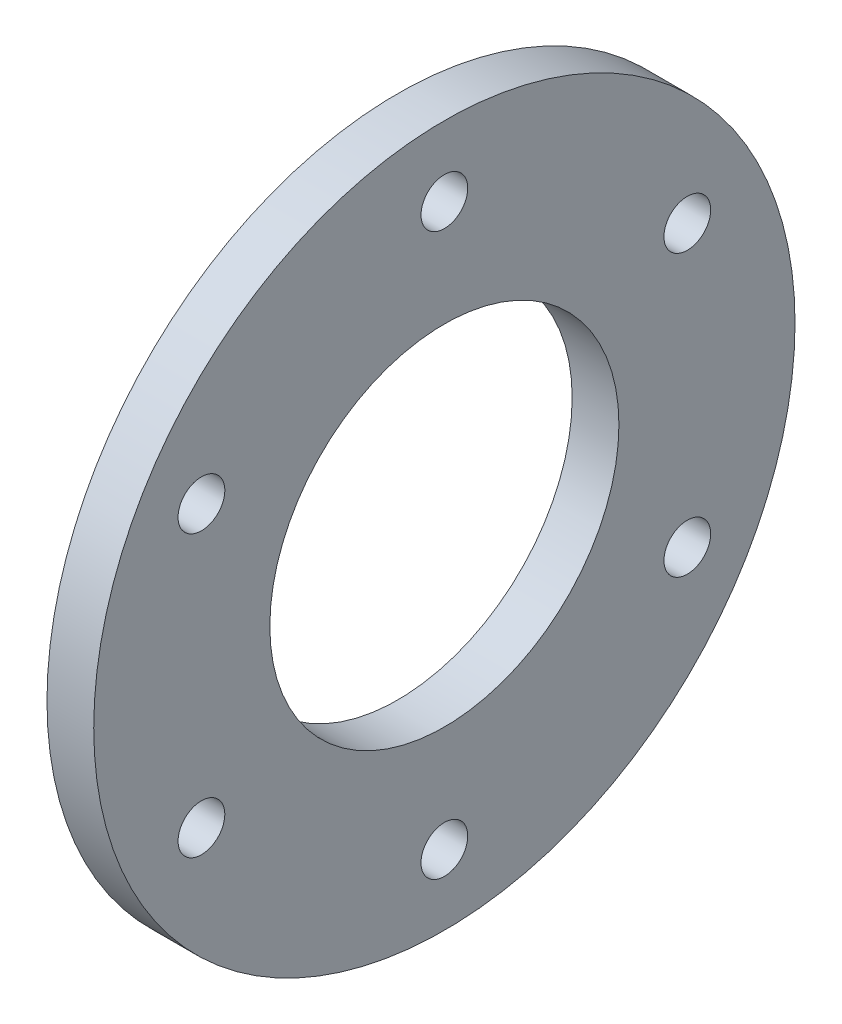
ISO-10303-21;
HEADER;
FILE_DESCRIPTION(('STEP AP214'),'2;1');
FILE_NAME('part.step','',(''),(''),'','','');
FILE_SCHEMA(('AUTOMOTIVE_DESIGN { 1 0 10303 214 1 1 1 1 }'));
ENDSEC;
DATA;
#1=APPLICATION_CONTEXT('core data for automotive mechanical design processes');
#2=APPLICATION_PROTOCOL_DEFINITION('international standard','automotive_design',2000,#1);
#3=PRODUCT_CONTEXT('',#1,'mechanical');
#4=PRODUCT('Part','Part','',(#3));
#5=PRODUCT_RELATED_PRODUCT_CATEGORY('part','',(#4));
#6=PRODUCT_DEFINITION_FORMATION('','',#4);
#7=PRODUCT_DEFINITION_CONTEXT('part definition',#1,'design');
#8=PRODUCT_DEFINITION('design','',#6,#7);
#9=PRODUCT_DEFINITION_SHAPE('','',#8);
#10=(LENGTH_UNIT() NAMED_UNIT(*) SI_UNIT(.MILLI.,.METRE.));
#11=(NAMED_UNIT(*) PLANE_ANGLE_UNIT() SI_UNIT($,.RADIAN.));
#12=(NAMED_UNIT(*) SI_UNIT($,.STERADIAN.) SOLID_ANGLE_UNIT());
#13=UNCERTAINTY_MEASURE_WITH_UNIT(LENGTH_MEASURE(1.E-05),#10,'distance_accuracy_value','');
#14=(GEOMETRIC_REPRESENTATION_CONTEXT(3) GLOBAL_UNCERTAINTY_ASSIGNED_CONTEXT((#13)) GLOBAL_UNIT_ASSIGNED_CONTEXT((#10,
#11,#12)) REPRESENTATION_CONTEXT('',''));
#15=CARTESIAN_POINT('',(0.,0.,0.));
#16=DIRECTION('',(0.,0.,1.));
#17=DIRECTION('',(1.,0.,0.));
#18=AXIS2_PLACEMENT_3D('',#15,#16,#17);
#19=CARTESIAN_POINT('',(3.,0.,0.));
#20=DIRECTION('',(1.,0.,0.));
#21=DIRECTION('',(0.,0.,-1.));
#22=AXIS2_PLACEMENT_3D('',#19,#20,#21);
#23=PLANE('',#22);
#24=CARTESIAN_POINT('',(3.,9.00000000000018,15.5884572681198));
#25=DIRECTION('',(1.,0.,0.));
#26=DIRECTION('',(0.,0.866025403784433,-0.50000000000001));
#27=AXIS2_PLACEMENT_3D('',#24,#25,#26);
#28=CIRCLE('',#27,1.5);
#29=CARTESIAN_POINT('',(3.,10.2990381056768,14.8384572681198));
#30=VERTEX_POINT('',#29);
#31=EDGE_CURVE('E83',#30,#30,#28,.T.);
#32=ORIENTED_EDGE('',*,*,#31,.F.);
#33=EDGE_LOOP('',(#32));
#34=FACE_BOUND('',#33,.T.);
#35=CARTESIAN_POINT('',(3.,-8.99999999999985,15.58845726812));
#36=DIRECTION('',(1.,0.,0.));
#37=DIRECTION('',(0.,0.866025403784443,0.499999999999992));
#38=AXIS2_PLACEMENT_3D('',#35,#36,#37);
#39=CIRCLE('',#38,1.5);
#40=CARTESIAN_POINT('',(3.,-7.70096189432319,16.33845726812));
#41=VERTEX_POINT('',#40);
#42=EDGE_CURVE('E77',#41,#41,#39,.T.);
#43=ORIENTED_EDGE('',*,*,#42,.F.);
#44=EDGE_LOOP('',(#43));
#45=FACE_BOUND('',#44,.T.);
#46=CARTESIAN_POINT('',(3.,-18.,1.25693400999938E-13));
#47=DIRECTION('',(1.,0.,0.));
#48=DIRECTION('',(0.,0.,1.));
#49=AXIS2_PLACEMENT_3D('',#46,#47,#48);
#50=CIRCLE('',#49,1.5);
#51=CARTESIAN_POINT('',(3.,-18.,1.50000000000013));
#52=VERTEX_POINT('',#51);
#53=EDGE_CURVE('E71',#52,#52,#50,.T.);
#54=ORIENTED_EDGE('',*,*,#53,.F.);
#55=EDGE_LOOP('',(#54));
#56=FACE_BOUND('',#55,.T.);
#57=CARTESIAN_POINT('',(3.,-9.00000000000007,-15.5884572681199));
#58=DIRECTION('',(1.,0.,0.));
#59=DIRECTION('',(0.,-0.866025403784436,0.500000000000004));
#60=AXIS2_PLACEMENT_3D('',#57,#58,#59);
#61=CIRCLE('',#60,1.5);
#62=CARTESIAN_POINT('',(3.,-10.2990381056767,-14.8384572681198));
#63=VERTEX_POINT('',#62);
#64=EDGE_CURVE('E65',#63,#63,#61,.T.);
#65=ORIENTED_EDGE('',*,*,#64,.F.);
#66=EDGE_LOOP('',(#65));
#67=FACE_BOUND('',#66,.T.);
#68=CARTESIAN_POINT('',(3.,8.99999999999996,-15.5884572681199));
#69=DIRECTION('',(1.,0.,0.));
#70=DIRECTION('',(0.,-0.86602540378444,-0.499999999999998));
#71=AXIS2_PLACEMENT_3D('',#68,#69,#70);
#72=CIRCLE('',#71,1.5);
#73=CARTESIAN_POINT('',(3.,7.7009618943233,-16.3384572681199));
#74=VERTEX_POINT('',#73);
#75=EDGE_CURVE('E59',#74,#74,#72,.T.);
#76=ORIENTED_EDGE('',*,*,#75,.F.);
#77=EDGE_LOOP('',(#76));
#78=FACE_BOUND('',#77,.T.);
#79=CARTESIAN_POINT('',(3.,18.,0.));
#80=DIRECTION('',(1.,0.,0.));
#81=DIRECTION('',(0.,0.,-1.));
#82=AXIS2_PLACEMENT_3D('',#79,#80,#81);
#83=CIRCLE('',#82,1.5);
#84=CARTESIAN_POINT('',(3.,18.,-1.5));
#85=VERTEX_POINT('',#84);
#86=EDGE_CURVE('E53',#85,#85,#83,.T.);
#87=ORIENTED_EDGE('',*,*,#86,.F.);
#88=EDGE_LOOP('',(#87));
#89=FACE_BOUND('',#88,.T.);
#90=CARTESIAN_POINT('',(3.,0.,0.));
#91=DIRECTION('',(1.,0.,0.));
#92=DIRECTION('',(0.,0.,-1.));
#93=AXIS2_PLACEMENT_3D('',#90,#91,#92);
#94=CIRCLE('',#93,22.5);
#95=CARTESIAN_POINT('',(3.,0.,-22.5));
#96=VERTEX_POINT('',#95);
#97=EDGE_CURVE('E10',#96,#96,#94,.T.);
#98=ORIENTED_EDGE('',*,*,#97,.T.);
#99=EDGE_LOOP('',(#98));
#100=FACE_BOUND('',#99,.T.);
#101=CARTESIAN_POINT('',(3.,0.,0.));
#102=DIRECTION('',(1.,0.,0.));
#103=DIRECTION('',(0.,0.,-1.));
#104=AXIS2_PLACEMENT_3D('',#101,#102,#103);
#105=CIRCLE('',#104,11.2);
#106=CARTESIAN_POINT('',(3.,0.,-11.2));
#107=VERTEX_POINT('',#106);
#108=EDGE_CURVE('E41',#107,#107,#105,.T.);
#109=ORIENTED_EDGE('',*,*,#108,.F.);
#110=EDGE_LOOP('',(#109));
#111=FACE_BOUND('',#110,.T.);
#112=ADVANCED_FACE('F30',(#34,#45,#56,#67,#78,#89,#100,#111),#23,.T.);
#113=CARTESIAN_POINT('',(0.,0.,0.));
#114=DIRECTION('',(1.,0.,0.));
#115=DIRECTION('',(0.,0.,-1.));
#116=AXIS2_PLACEMENT_3D('',#113,#114,#115);
#117=PLANE('',#116);
#118=CARTESIAN_POINT('',(0.,9.00000000000018,15.5884572681198));
#119=DIRECTION('',(1.,0.,0.));
#120=DIRECTION('',(0.,0.866025403784433,-0.50000000000001));
#121=AXIS2_PLACEMENT_3D('',#118,#119,#120);
#122=CIRCLE('',#121,1.5);
#123=CARTESIAN_POINT('',(0.,10.2990381056768,14.8384572681198));
#124=VERTEX_POINT('',#123);
#125=EDGE_CURVE('E80',#124,#124,#122,.T.);
#126=ORIENTED_EDGE('',*,*,#125,.T.);
#127=EDGE_LOOP('',(#126));
#128=FACE_BOUND('',#127,.T.);
#129=CARTESIAN_POINT('',(0.,-8.99999999999985,15.58845726812));
#130=DIRECTION('',(1.,0.,0.));
#131=DIRECTION('',(0.,0.866025403784443,0.499999999999992));
#132=AXIS2_PLACEMENT_3D('',#129,#130,#131);
#133=CIRCLE('',#132,1.5);
#134=CARTESIAN_POINT('',(0.,-7.70096189432319,16.33845726812));
#135=VERTEX_POINT('',#134);
#136=EDGE_CURVE('E74',#135,#135,#133,.T.);
#137=ORIENTED_EDGE('',*,*,#136,.T.);
#138=EDGE_LOOP('',(#137));
#139=FACE_BOUND('',#138,.T.);
#140=CARTESIAN_POINT('',(0.,-18.,1.25693400999938E-13));
#141=DIRECTION('',(1.,0.,0.));
#142=DIRECTION('',(0.,0.,1.));
#143=AXIS2_PLACEMENT_3D('',#140,#141,#142);
#144=CIRCLE('',#143,1.5);
#145=CARTESIAN_POINT('',(0.,-18.,1.50000000000013));
#146=VERTEX_POINT('',#145);
#147=EDGE_CURVE('E68',#146,#146,#144,.T.);
#148=ORIENTED_EDGE('',*,*,#147,.T.);
#149=EDGE_LOOP('',(#148));
#150=FACE_BOUND('',#149,.T.);
#151=CARTESIAN_POINT('',(0.,-9.00000000000007,-15.5884572681199));
#152=DIRECTION('',(1.,0.,0.));
#153=DIRECTION('',(0.,-0.866025403784436,0.500000000000004));
#154=AXIS2_PLACEMENT_3D('',#151,#152,#153);
#155=CIRCLE('',#154,1.5);
#156=CARTESIAN_POINT('',(0.,-10.2990381056767,-14.8384572681198));
#157=VERTEX_POINT('',#156);
#158=EDGE_CURVE('E62',#157,#157,#155,.T.);
#159=ORIENTED_EDGE('',*,*,#158,.T.);
#160=EDGE_LOOP('',(#159));
#161=FACE_BOUND('',#160,.T.);
#162=CARTESIAN_POINT('',(0.,8.99999999999996,-15.5884572681199));
#163=DIRECTION('',(1.,0.,0.));
#164=DIRECTION('',(0.,-0.86602540378444,-0.499999999999998));
#165=AXIS2_PLACEMENT_3D('',#162,#163,#164);
#166=CIRCLE('',#165,1.5);
#167=CARTESIAN_POINT('',(0.,7.7009618943233,-16.3384572681199));
#168=VERTEX_POINT('',#167);
#169=EDGE_CURVE('E56',#168,#168,#166,.T.);
#170=ORIENTED_EDGE('',*,*,#169,.T.);
#171=EDGE_LOOP('',(#170));
#172=FACE_BOUND('',#171,.T.);
#173=CARTESIAN_POINT('',(0.,18.,0.));
#174=DIRECTION('',(1.,0.,0.));
#175=DIRECTION('',(0.,0.,-1.));
#176=AXIS2_PLACEMENT_3D('',#173,#174,#175);
#177=CIRCLE('',#176,1.5);
#178=CARTESIAN_POINT('',(0.,18.,-1.5));
#179=VERTEX_POINT('',#178);
#180=EDGE_CURVE('E50',#179,#179,#177,.T.);
#181=ORIENTED_EDGE('',*,*,#180,.T.);
#182=EDGE_LOOP('',(#181));
#183=FACE_BOUND('',#182,.T.);
#184=CARTESIAN_POINT('',(0.,0.,0.));
#185=DIRECTION('',(1.,0.,0.));
#186=DIRECTION('',(0.,0.,-1.));
#187=AXIS2_PLACEMENT_3D('',#184,#185,#186);
#188=CIRCLE('',#187,22.5);
#189=CARTESIAN_POINT('',(0.,0.,-22.5));
#190=VERTEX_POINT('',#189);
#191=EDGE_CURVE('E37',#190,#190,#188,.T.);
#192=ORIENTED_EDGE('',*,*,#191,.F.);
#193=EDGE_LOOP('',(#192));
#194=FACE_BOUND('',#193,.T.);
#195=CARTESIAN_POINT('',(0.,0.,0.));
#196=DIRECTION('',(1.,0.,0.));
#197=DIRECTION('',(0.,0.,-1.));
#198=AXIS2_PLACEMENT_3D('',#195,#196,#197);
#199=CIRCLE('',#198,11.2);
#200=CARTESIAN_POINT('',(0.,0.,-11.2));
#201=VERTEX_POINT('',#200);
#202=EDGE_CURVE('E45',#201,#201,#199,.T.);
#203=ORIENTED_EDGE('',*,*,#202,.T.);
#204=EDGE_LOOP('',(#203));
#205=FACE_BOUND('',#204,.T.);
#206=ADVANCED_FACE('F91',(#128,#139,#150,#161,#172,#183,#194,#205),#117,.F.);
#207=CARTESIAN_POINT('',(3.,0.,0.));
#208=DIRECTION('',(-1.,0.,0.));
#209=DIRECTION('',(0.,0.,1.));
#210=AXIS2_PLACEMENT_3D('',#207,#208,#209);
#211=CYLINDRICAL_SURFACE('',#210,22.5);
#212=ORIENTED_EDGE('',*,*,#97,.F.);
#213=EDGE_LOOP('',(#212));
#214=FACE_BOUND('',#213,.T.);
#215=ORIENTED_EDGE('',*,*,#191,.T.);
#216=EDGE_LOOP('',(#215));
#217=FACE_BOUND('',#216,.T.);
#218=ADVANCED_FACE('F32',(#214,#217),#211,.T.);
#219=CARTESIAN_POINT('',(3.,0.,0.));
#220=DIRECTION('',(-1.,0.,0.));
#221=DIRECTION('',(0.,0.,1.));
#222=AXIS2_PLACEMENT_3D('',#219,#220,#221);
#223=CYLINDRICAL_SURFACE('',#222,11.2);
#224=ORIENTED_EDGE('',*,*,#108,.T.);
#225=EDGE_LOOP('',(#224));
#226=FACE_BOUND('',#225,.T.);
#227=ORIENTED_EDGE('',*,*,#202,.F.);
#228=EDGE_LOOP('',(#227));
#229=FACE_BOUND('',#228,.T.);
#230=ADVANCED_FACE('F104',(#226,#229),#223,.F.);
#231=CARTESIAN_POINT('',(0.,18.,0.));
#232=DIRECTION('',(1.,0.,0.));
#233=DIRECTION('',(0.,0.,-1.));
#234=AXIS2_PLACEMENT_3D('',#231,#232,#233);
#235=CYLINDRICAL_SURFACE('',#234,1.5);
#236=ORIENTED_EDGE('',*,*,#180,.F.);
#237=EDGE_LOOP('',(#236));
#238=FACE_BOUND('',#237,.T.);
#239=ORIENTED_EDGE('',*,*,#86,.T.);
#240=EDGE_LOOP('',(#239));
#241=FACE_BOUND('',#240,.T.);
#242=ADVANCED_FACE('F107',(#238,#241),#235,.F.);
#243=CARTESIAN_POINT('',(0.,8.99999999999996,-15.5884572681199));
#244=DIRECTION('',(1.,0.,0.));
#245=DIRECTION('',(0.,0.,-1.));
#246=AXIS2_PLACEMENT_3D('',#243,#244,#245);
#247=CYLINDRICAL_SURFACE('',#246,1.5);
#248=ORIENTED_EDGE('',*,*,#169,.F.);
#249=EDGE_LOOP('',(#248));
#250=FACE_BOUND('',#249,.T.);
#251=ORIENTED_EDGE('',*,*,#75,.T.);
#252=EDGE_LOOP('',(#251));
#253=FACE_BOUND('',#252,.T.);
#254=ADVANCED_FACE('F122',(#250,#253),#247,.F.);
#255=CARTESIAN_POINT('',(0.,-9.00000000000007,-15.5884572681199));
#256=DIRECTION('',(1.,0.,0.));
#257=DIRECTION('',(0.,0.,-1.));
#258=AXIS2_PLACEMENT_3D('',#255,#256,#257);
#259=CYLINDRICAL_SURFACE('',#258,1.5);
#260=ORIENTED_EDGE('',*,*,#158,.F.);
#261=EDGE_LOOP('',(#260));
#262=FACE_BOUND('',#261,.T.);
#263=ORIENTED_EDGE('',*,*,#64,.T.);
#264=EDGE_LOOP('',(#263));
#265=FACE_BOUND('',#264,.T.);
#266=ADVANCED_FACE('F126',(#262,#265),#259,.F.);
#267=CARTESIAN_POINT('',(0.,-18.,1.25693400999938E-13));
#268=DIRECTION('',(1.,0.,0.));
#269=DIRECTION('',(0.,0.,-1.));
#270=AXIS2_PLACEMENT_3D('',#267,#268,#269);
#271=CYLINDRICAL_SURFACE('',#270,1.5);
#272=ORIENTED_EDGE('',*,*,#147,.F.);
#273=EDGE_LOOP('',(#272));
#274=FACE_BOUND('',#273,.T.);
#275=ORIENTED_EDGE('',*,*,#53,.T.);
#276=EDGE_LOOP('',(#275));
#277=FACE_BOUND('',#276,.T.);
#278=ADVANCED_FACE('F130',(#274,#277),#271,.F.);
#279=CARTESIAN_POINT('',(0.,-8.99999999999985,15.58845726812));
#280=DIRECTION('',(1.,0.,0.));
#281=DIRECTION('',(0.,0.,-1.));
#282=AXIS2_PLACEMENT_3D('',#279,#280,#281);
#283=CYLINDRICAL_SURFACE('',#282,1.5);
#284=ORIENTED_EDGE('',*,*,#136,.F.);
#285=EDGE_LOOP('',(#284));
#286=FACE_BOUND('',#285,.T.);
#287=ORIENTED_EDGE('',*,*,#42,.T.);
#288=EDGE_LOOP('',(#287));
#289=FACE_BOUND('',#288,.T.);
#290=ADVANCED_FACE('F134',(#286,#289),#283,.F.);
#291=CARTESIAN_POINT('',(0.,9.00000000000018,15.5884572681198));
#292=DIRECTION('',(1.,0.,0.));
#293=DIRECTION('',(0.,0.,-1.));
#294=AXIS2_PLACEMENT_3D('',#291,#292,#293);
#295=CYLINDRICAL_SURFACE('',#294,1.5);
#296=ORIENTED_EDGE('',*,*,#125,.F.);
#297=EDGE_LOOP('',(#296));
#298=FACE_BOUND('',#297,.T.);
#299=ORIENTED_EDGE('',*,*,#31,.T.);
#300=EDGE_LOOP('',(#299));
#301=FACE_BOUND('',#300,.T.);
#302=ADVANCED_FACE('F87',(#298,#301),#295,.F.);
#303=CLOSED_SHELL('',(#112,#206,#218,#230,#242,#254,#266,#278,#290,#302));
#304=MANIFOLD_SOLID_BREP('B2',#303);
#305=ADVANCED_BREP_SHAPE_REPRESENTATION('',(#18,#304),#14);
#306=SHAPE_DEFINITION_REPRESENTATION(#9,#305);
ENDSEC;
END-ISO-10303-21;
